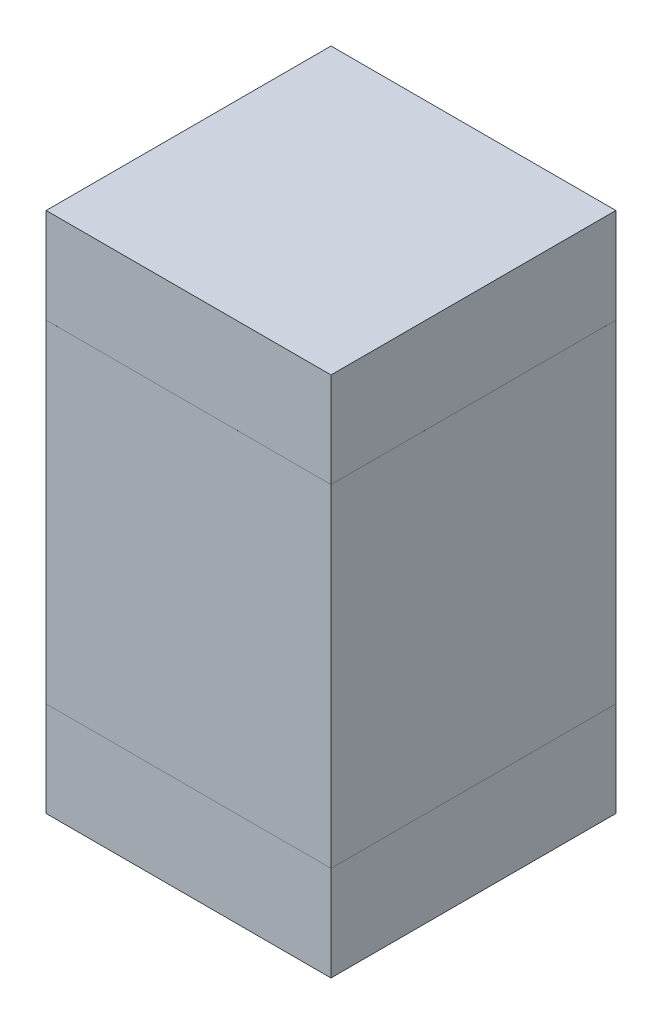
ISO-10303-21;
HEADER;
FILE_DESCRIPTION(('STEP AP214'),'2;1');
FILE_NAME('part.step','',(''),(''),'','','');
FILE_SCHEMA(('AUTOMOTIVE_DESIGN { 1 0 10303 214 1 1 1 1 }'));
ENDSEC;
DATA;
#1=APPLICATION_CONTEXT('core data for automotive mechanical design processes');
#2=APPLICATION_PROTOCOL_DEFINITION('international standard','automotive_design',2000,#1);
#3=PRODUCT_CONTEXT('',#1,'mechanical');
#4=PRODUCT('Part','Part','',(#3));
#5=PRODUCT_RELATED_PRODUCT_CATEGORY('part','',(#4));
#6=PRODUCT_DEFINITION_FORMATION('','',#4);
#7=PRODUCT_DEFINITION_CONTEXT('part definition',#1,'design');
#8=PRODUCT_DEFINITION('design','',#6,#7);
#9=PRODUCT_DEFINITION_SHAPE('','',#8);
#10=(LENGTH_UNIT() NAMED_UNIT(*) SI_UNIT(.MILLI.,.METRE.));
#11=(NAMED_UNIT(*) PLANE_ANGLE_UNIT() SI_UNIT($,.RADIAN.));
#12=(NAMED_UNIT(*) SI_UNIT($,.STERADIAN.) SOLID_ANGLE_UNIT());
#13=UNCERTAINTY_MEASURE_WITH_UNIT(LENGTH_MEASURE(1.E-05),#10,'distance_accuracy_value','');
#14=(GEOMETRIC_REPRESENTATION_CONTEXT(3) GLOBAL_UNCERTAINTY_ASSIGNED_CONTEXT((#13)) GLOBAL_UNIT_ASSIGNED_CONTEXT((#10,
#11,#12)) REPRESENTATION_CONTEXT('',''));
#15=CARTESIAN_POINT('',(0.,0.,0.));
#16=DIRECTION('',(0.,0.,1.));
#17=DIRECTION('',(1.,0.,0.));
#18=AXIS2_PLACEMENT_3D('',#15,#16,#17);
#19=CARTESIAN_POINT('',(1.449994365938,1.924995622559,0.5999988));
#20=DIRECTION('',(0.,0.,-1.));
#21=DIRECTION('',(0.,-1.,0.));
#22=AXIS2_PLACEMENT_3D('',#19,#20,#21);
#23=PLANE('',#22);
#24=DIRECTION('',(-1.,0.,0.));
#25=VECTOR('',#24,1.);
#26=CARTESIAN_POINT('',(1.449994365938,1.924995622559,0.5999988));
#27=LINE('',#26,#25);
#28=CARTESIAN_POINT('',(1.449994365938,1.924995622559,0.5999988));
#29=VERTEX_POINT('',#28);
#30=CARTESIAN_POINT('',(0.849995565938,1.924995622559,0.5999988));
#31=VERTEX_POINT('',#30);
#32=EDGE_CURVE('P0_E79',#29,#31,#27,.T.);
#33=ORIENTED_EDGE('',*,*,#32,.T.);
#34=DIRECTION('',(0.,-1.,0.));
#35=VECTOR('',#34,1.);
#36=CARTESIAN_POINT('',(0.849995565938,1.924995622559,0.5999988));
#37=LINE('',#36,#35);
#38=CARTESIAN_POINT('',(0.849995565938,1.224994482559,0.5999988));
#39=VERTEX_POINT('',#38);
#40=EDGE_CURVE('P0_E101',#31,#39,#37,.T.);
#41=ORIENTED_EDGE('',*,*,#40,.T.);
#42=DIRECTION('',(1.,0.,0.));
#43=VECTOR('',#42,1.);
#44=CARTESIAN_POINT('',(0.849995565938,1.224994482559,0.5999988));
#45=LINE('',#44,#43);
#46=CARTESIAN_POINT('',(1.449994365938,1.224994482559,0.5999988));
#47=VERTEX_POINT('',#46);
#48=EDGE_CURVE('P0_E72',#39,#47,#45,.T.);
#49=ORIENTED_EDGE('',*,*,#48,.T.);
#50=DIRECTION('',(0.,1.,0.));
#51=VECTOR('',#50,1.);
#52=CARTESIAN_POINT('',(1.449994365938,1.224994482559,0.5999988));
#53=LINE('',#52,#51);
#54=EDGE_CURVE('P0_E11',#47,#29,#53,.T.);
#55=ORIENTED_EDGE('',*,*,#54,.T.);
#56=EDGE_LOOP('',(#33,#41,#49,#55));
#57=FACE_BOUND('',#56,.T.);
#58=ADVANCED_FACE('P0_F17',(#57),#23,.F.);
#59=CARTESIAN_POINT('',(1.449994365938,1.924995622559,0.));
#60=DIRECTION('',(0.,0.,-1.));
#61=DIRECTION('',(0.,-1.,0.));
#62=AXIS2_PLACEMENT_3D('',#59,#60,#61);
#63=PLANE('',#62);
#64=DIRECTION('',(0.,1.,0.));
#65=VECTOR('',#64,1.);
#66=CARTESIAN_POINT('',(1.449994365938,1.224994482559,0.));
#67=LINE('',#66,#65);
#68=CARTESIAN_POINT('',(1.449994365938,1.224994482559,0.));
#69=VERTEX_POINT('',#68);
#70=CARTESIAN_POINT('',(1.449994365938,1.924995622559,0.));
#71=VERTEX_POINT('',#70);
#72=EDGE_CURVE('P0_E20',#69,#71,#67,.T.);
#73=ORIENTED_EDGE('',*,*,#72,.F.);
#74=DIRECTION('',(1.,0.,0.));
#75=VECTOR('',#74,1.);
#76=CARTESIAN_POINT('',(0.849995565938,1.224994482559,0.));
#77=LINE('',#76,#75);
#78=CARTESIAN_POINT('',(0.849995565938,1.224994482559,0.));
#79=VERTEX_POINT('',#78);
#80=EDGE_CURVE('P0_E102',#79,#69,#77,.T.);
#81=ORIENTED_EDGE('',*,*,#80,.F.);
#82=DIRECTION('',(0.,-1.,0.));
#83=VECTOR('',#82,1.);
#84=CARTESIAN_POINT('',(0.849995565938,1.924995622559,0.));
#85=LINE('',#84,#83);
#86=CARTESIAN_POINT('',(0.849995565938,1.924995622559,0.));
#87=VERTEX_POINT('',#86);
#88=EDGE_CURVE('P0_E81',#87,#79,#85,.T.);
#89=ORIENTED_EDGE('',*,*,#88,.F.);
#90=DIRECTION('',(-1.,0.,0.));
#91=VECTOR('',#90,1.);
#92=CARTESIAN_POINT('',(1.449994365938,1.924995622559,0.));
#93=LINE('',#92,#91);
#94=EDGE_CURVE('P0_E77',#71,#87,#93,.T.);
#95=ORIENTED_EDGE('',*,*,#94,.F.);
#96=EDGE_LOOP('',(#73,#81,#89,#95));
#97=FACE_BOUND('',#96,.T.);
#98=ADVANCED_FACE('P0_F83',(#97),#63,.T.);
#99=CARTESIAN_POINT('',(1.449994365938,1.224994482559,0.));
#100=DIRECTION('',(-1.,0.,0.));
#101=DIRECTION('',(0.,0.,1.));
#102=AXIS2_PLACEMENT_3D('',#99,#100,#101);
#103=PLANE('',#102);
#104=ORIENTED_EDGE('',*,*,#72,.T.);
#105=DIRECTION('',(0.,0.,1.));
#106=VECTOR('',#105,1.);
#107=CARTESIAN_POINT('',(1.449994365938,1.924995622559,0.));
#108=LINE('',#107,#106);
#109=EDGE_CURVE('P0_E63',#71,#29,#108,.T.);
#110=ORIENTED_EDGE('',*,*,#109,.T.);
#111=ORIENTED_EDGE('',*,*,#54,.F.);
#112=DIRECTION('',(0.,0.,1.));
#113=VECTOR('',#112,1.);
#114=CARTESIAN_POINT('',(1.449994365938,1.224994482559,0.));
#115=LINE('',#114,#113);
#116=EDGE_CURVE('P0_E66',#69,#47,#115,.T.);
#117=ORIENTED_EDGE('',*,*,#116,.F.);
#118=EDGE_LOOP('',(#104,#110,#111,#117));
#119=FACE_BOUND('',#118,.T.);
#120=ADVANCED_FACE('P0_F62',(#119),#103,.F.);
#121=CARTESIAN_POINT('',(0.849995565938,1.224994482559,0.));
#122=DIRECTION('',(0.,1.,0.));
#123=DIRECTION('',(1.,0.,0.));
#124=AXIS2_PLACEMENT_3D('',#121,#122,#123);
#125=PLANE('',#124);
#126=ORIENTED_EDGE('',*,*,#80,.T.);
#127=ORIENTED_EDGE('',*,*,#116,.T.);
#128=ORIENTED_EDGE('',*,*,#48,.F.);
#129=DIRECTION('',(0.,0.,1.));
#130=VECTOR('',#129,1.);
#131=CARTESIAN_POINT('',(0.849995565938,1.224994482559,0.));
#132=LINE('',#131,#130);
#133=EDGE_CURVE('P0_E96',#79,#39,#132,.T.);
#134=ORIENTED_EDGE('',*,*,#133,.F.);
#135=EDGE_LOOP('',(#126,#127,#128,#134));
#136=FACE_BOUND('',#135,.T.);
#137=ADVANCED_FACE('P0_F114',(#136),#125,.F.);
#138=CARTESIAN_POINT('',(0.849995565938,1.924995622559,0.));
#139=DIRECTION('',(1.,0.,0.));
#140=DIRECTION('',(0.,1.,0.));
#141=AXIS2_PLACEMENT_3D('',#138,#139,#140);
#142=PLANE('',#141);
#143=ORIENTED_EDGE('',*,*,#88,.T.);
#144=ORIENTED_EDGE('',*,*,#133,.T.);
#145=ORIENTED_EDGE('',*,*,#40,.F.);
#146=DIRECTION('',(0.,0.,1.));
#147=VECTOR('',#146,1.);
#148=CARTESIAN_POINT('',(0.849995565938,1.924995622559,0.));
#149=LINE('',#148,#147);
#150=EDGE_CURVE('P0_E87',#87,#31,#149,.T.);
#151=ORIENTED_EDGE('',*,*,#150,.F.);
#152=EDGE_LOOP('',(#143,#144,#145,#151));
#153=FACE_BOUND('',#152,.T.);
#154=ADVANCED_FACE('P0_F172',(#153),#142,.F.);
#155=CARTESIAN_POINT('',(1.449994365938,1.924995622559,0.));
#156=DIRECTION('',(0.,-1.,0.));
#157=DIRECTION('',(0.,0.,-1.));
#158=AXIS2_PLACEMENT_3D('',#155,#156,#157);
#159=PLANE('',#158);
#160=ORIENTED_EDGE('',*,*,#94,.T.);
#161=ORIENTED_EDGE('',*,*,#150,.T.);
#162=ORIENTED_EDGE('',*,*,#32,.F.);
#163=ORIENTED_EDGE('',*,*,#109,.F.);
#164=EDGE_LOOP('',(#160,#161,#162,#163));
#165=FACE_BOUND('',#164,.T.);
#166=ADVANCED_FACE('P0_F75',(#165),#159,.F.);
#167=CLOSED_SHELL('',(#58,#98,#120,#137,#154,#166));
#168=MANIFOLD_SOLID_BREP('P0_B1',#167);
#169=CARTESIAN_POINT('',(1.449994365938,2.124998160195,0.5999988));
#170=DIRECTION('',(0.,0.,-1.));
#171=DIRECTION('',(0.,-1.,0.));
#172=AXIS2_PLACEMENT_3D('',#169,#170,#171);
#173=PLANE('',#172);
#174=DIRECTION('',(-1.,0.,0.));
#175=VECTOR('',#174,1.);
#176=CARTESIAN_POINT('',(1.449994365938,2.124998160195,0.5999988));
#177=LINE('',#176,#175);
#178=CARTESIAN_POINT('',(1.449994365938,2.124998160195,0.5999988));
#179=VERTEX_POINT('',#178);
#180=CARTESIAN_POINT('',(0.849995565938,2.124998160195,0.5999988));
#181=VERTEX_POINT('',#180);
#182=EDGE_CURVE('P1_E97',#179,#181,#177,.T.);
#183=ORIENTED_EDGE('',*,*,#182,.T.);
#184=DIRECTION('',(0.,-1.,0.));
#185=VECTOR('',#184,1.);
#186=CARTESIAN_POINT('',(0.849995565938,2.124998160195,0.5999988));
#187=LINE('',#186,#185);
#188=CARTESIAN_POINT('',(0.849995565938,1.924998560195,0.5999988));
#189=VERTEX_POINT('',#188);
#190=EDGE_CURVE('P1_E76',#181,#189,#187,.T.);
#191=ORIENTED_EDGE('',*,*,#190,.T.);
#192=DIRECTION('',(1.,0.,0.));
#193=VECTOR('',#192,1.);
#194=CARTESIAN_POINT('',(0.849995565938,1.924998560195,0.5999988));
#195=LINE('',#194,#193);
#196=CARTESIAN_POINT('',(1.449994365938,1.924998560195,0.5999988));
#197=VERTEX_POINT('',#196);
#198=EDGE_CURVE('P1_E81',#189,#197,#195,.T.);
#199=ORIENTED_EDGE('',*,*,#198,.T.);
#200=DIRECTION('',(0.,1.,0.));
#201=VECTOR('',#200,1.);
#202=CARTESIAN_POINT('',(1.449994365938,1.924998560195,0.5999988));
#203=LINE('',#202,#201);
#204=EDGE_CURVE('P1_E11',#197,#179,#203,.T.);
#205=ORIENTED_EDGE('',*,*,#204,.T.);
#206=EDGE_LOOP('',(#183,#191,#199,#205));
#207=FACE_BOUND('',#206,.T.);
#208=ADVANCED_FACE('P1_F17',(#207),#173,.F.);
#209=CARTESIAN_POINT('',(1.449994365938,2.124998160195,0.));
#210=DIRECTION('',(0.,0.,-1.));
#211=DIRECTION('',(0.,-1.,0.));
#212=AXIS2_PLACEMENT_3D('',#209,#210,#211);
#213=PLANE('',#212);
#214=DIRECTION('',(0.,1.,0.));
#215=VECTOR('',#214,1.);
#216=CARTESIAN_POINT('',(1.449994365938,1.924998560195,0.));
#217=LINE('',#216,#215);
#218=CARTESIAN_POINT('',(1.449994365938,1.924998560195,0.));
#219=VERTEX_POINT('',#218);
#220=CARTESIAN_POINT('',(1.449994365938,2.124998160195,0.));
#221=VERTEX_POINT('',#220);
#222=EDGE_CURVE('P1_E25',#219,#221,#217,.T.);
#223=ORIENTED_EDGE('',*,*,#222,.F.);
#224=DIRECTION('',(1.,0.,0.));
#225=VECTOR('',#224,1.);
#226=CARTESIAN_POINT('',(0.849995565938,1.924998560195,0.));
#227=LINE('',#226,#225);
#228=CARTESIAN_POINT('',(0.849995565938,1.924998560195,0.));
#229=VERTEX_POINT('',#228);
#230=EDGE_CURVE('P1_E66',#229,#219,#227,.T.);
#231=ORIENTED_EDGE('',*,*,#230,.F.);
#232=DIRECTION('',(0.,-1.,0.));
#233=VECTOR('',#232,1.);
#234=CARTESIAN_POINT('',(0.849995565938,2.124998160195,0.));
#235=LINE('',#234,#233);
#236=CARTESIAN_POINT('',(0.849995565938,2.124998160195,0.));
#237=VERTEX_POINT('',#236);
#238=EDGE_CURVE('P1_E70',#237,#229,#235,.T.);
#239=ORIENTED_EDGE('',*,*,#238,.F.);
#240=DIRECTION('',(-1.,0.,0.));
#241=VECTOR('',#240,1.);
#242=CARTESIAN_POINT('',(1.449994365938,2.124998160195,0.));
#243=LINE('',#242,#241);
#244=EDGE_CURVE('P1_E114',#221,#237,#243,.T.);
#245=ORIENTED_EDGE('',*,*,#244,.F.);
#246=EDGE_LOOP('',(#223,#231,#239,#245));
#247=FACE_BOUND('',#246,.T.);
#248=ADVANCED_FACE('P1_F68',(#247),#213,.T.);
#249=CARTESIAN_POINT('',(1.449994365938,1.924998560195,0.));
#250=DIRECTION('',(-1.,0.,0.));
#251=DIRECTION('',(0.,0.,1.));
#252=AXIS2_PLACEMENT_3D('',#249,#250,#251);
#253=PLANE('',#252);
#254=ORIENTED_EDGE('',*,*,#222,.T.);
#255=DIRECTION('',(0.,0.,1.));
#256=VECTOR('',#255,1.);
#257=CARTESIAN_POINT('',(1.449994365938,2.124998160195,0.));
#258=LINE('',#257,#256);
#259=EDGE_CURVE('P1_E91',#221,#179,#258,.T.);
#260=ORIENTED_EDGE('',*,*,#259,.T.);
#261=ORIENTED_EDGE('',*,*,#204,.F.);
#262=DIRECTION('',(0.,0.,1.));
#263=VECTOR('',#262,1.);
#264=CARTESIAN_POINT('',(1.449994365938,1.924998560195,0.));
#265=LINE('',#264,#263);
#266=EDGE_CURVE('P1_E75',#219,#197,#265,.T.);
#267=ORIENTED_EDGE('',*,*,#266,.F.);
#268=EDGE_LOOP('',(#254,#260,#261,#267));
#269=FACE_BOUND('',#268,.T.);
#270=ADVANCED_FACE('P1_F110',(#269),#253,.F.);
#271=CARTESIAN_POINT('',(0.849995565938,1.924998560195,0.));
#272=DIRECTION('',(0.,1.,0.));
#273=DIRECTION('',(1.,0.,0.));
#274=AXIS2_PLACEMENT_3D('',#271,#272,#273);
#275=PLANE('',#274);
#276=ORIENTED_EDGE('',*,*,#230,.T.);
#277=ORIENTED_EDGE('',*,*,#266,.T.);
#278=ORIENTED_EDGE('',*,*,#198,.F.);
#279=DIRECTION('',(0.,0.,1.));
#280=VECTOR('',#279,1.);
#281=CARTESIAN_POINT('',(0.849995565938,1.924998560195,0.));
#282=LINE('',#281,#280);
#283=EDGE_CURVE('P1_E79',#229,#189,#282,.T.);
#284=ORIENTED_EDGE('',*,*,#283,.F.);
#285=EDGE_LOOP('',(#276,#277,#278,#284));
#286=FACE_BOUND('',#285,.T.);
#287=ADVANCED_FACE('P1_F80',(#286),#275,.F.);
#288=CARTESIAN_POINT('',(0.849995565938,2.124998160195,0.));
#289=DIRECTION('',(1.,0.,0.));
#290=DIRECTION('',(0.,1.,0.));
#291=AXIS2_PLACEMENT_3D('',#288,#289,#290);
#292=PLANE('',#291);
#293=ORIENTED_EDGE('',*,*,#238,.T.);
#294=ORIENTED_EDGE('',*,*,#283,.T.);
#295=ORIENTED_EDGE('',*,*,#190,.F.);
#296=DIRECTION('',(0.,0.,1.));
#297=VECTOR('',#296,1.);
#298=CARTESIAN_POINT('',(0.849995565938,2.124998160195,0.));
#299=LINE('',#298,#297);
#300=EDGE_CURVE('P1_E88',#237,#181,#299,.T.);
#301=ORIENTED_EDGE('',*,*,#300,.F.);
#302=EDGE_LOOP('',(#293,#294,#295,#301));
#303=FACE_BOUND('',#302,.T.);
#304=ADVANCED_FACE('P1_F86',(#303),#292,.F.);
#305=CARTESIAN_POINT('',(1.449994365938,2.124998160195,0.));
#306=DIRECTION('',(0.,-1.,0.));
#307=DIRECTION('',(0.,0.,-1.));
#308=AXIS2_PLACEMENT_3D('',#305,#306,#307);
#309=PLANE('',#308);
#310=ORIENTED_EDGE('',*,*,#244,.T.);
#311=ORIENTED_EDGE('',*,*,#300,.T.);
#312=ORIENTED_EDGE('',*,*,#182,.F.);
#313=ORIENTED_EDGE('',*,*,#259,.F.);
#314=EDGE_LOOP('',(#310,#311,#312,#313));
#315=FACE_BOUND('',#314,.T.);
#316=ADVANCED_FACE('P1_F113',(#315),#309,.F.);
#317=CLOSED_SHELL('',(#208,#248,#270,#287,#304,#316));
#318=MANIFOLD_SOLID_BREP('P1_B1',#317);
#319=CARTESIAN_POINT('',(1.449994365938,1.224996634316,0.5999988));
#320=DIRECTION('',(0.,0.,-1.));
#321=DIRECTION('',(0.,-1.,0.));
#322=AXIS2_PLACEMENT_3D('',#319,#320,#321);
#323=PLANE('',#322);
#324=DIRECTION('',(-1.,0.,0.));
#325=VECTOR('',#324,1.);
#326=CARTESIAN_POINT('',(1.449994365938,1.224996634316,0.5999988));
#327=LINE('',#326,#325);
#328=CARTESIAN_POINT('',(1.449994365938,1.224996634316,0.5999988));
#329=VERTEX_POINT('',#328);
#330=CARTESIAN_POINT('',(0.849995565938,1.224996634316,0.5999988));
#331=VERTEX_POINT('',#330);
#332=EDGE_CURVE('P2_E82',#329,#331,#327,.T.);
#333=ORIENTED_EDGE('',*,*,#332,.T.);
#334=DIRECTION('',(0.,-1.,0.));
#335=VECTOR('',#334,1.);
#336=CARTESIAN_POINT('',(0.849995565938,1.224996634316,0.5999988));
#337=LINE('',#336,#335);
#338=CARTESIAN_POINT('',(0.849995565938,1.024997034316,0.5999988));
#339=VERTEX_POINT('',#338);
#340=EDGE_CURVE('P2_E100',#331,#339,#337,.T.);
#341=ORIENTED_EDGE('',*,*,#340,.T.);
#342=DIRECTION('',(1.,0.,0.));
#343=VECTOR('',#342,1.);
#344=CARTESIAN_POINT('',(0.849995565938,1.024997034316,0.5999988));
#345=LINE('',#344,#343);
#346=CARTESIAN_POINT('',(1.449994365938,1.024997034316,0.5999988));
#347=VERTEX_POINT('',#346);
#348=EDGE_CURVE('P2_E75',#339,#347,#345,.T.);
#349=ORIENTED_EDGE('',*,*,#348,.T.);
#350=DIRECTION('',(0.,1.,0.));
#351=VECTOR('',#350,1.);
#352=CARTESIAN_POINT('',(1.449994365938,1.024997034316,0.5999988));
#353=LINE('',#352,#351);
#354=EDGE_CURVE('P2_E11',#347,#329,#353,.T.);
#355=ORIENTED_EDGE('',*,*,#354,.T.);
#356=EDGE_LOOP('',(#333,#341,#349,#355));
#357=FACE_BOUND('',#356,.T.);
#358=ADVANCED_FACE('P2_F17',(#357),#323,.F.);
#359=CARTESIAN_POINT('',(1.449994365938,1.224996634316,0.));
#360=DIRECTION('',(0.,0.,-1.));
#361=DIRECTION('',(0.,-1.,0.));
#362=AXIS2_PLACEMENT_3D('',#359,#360,#361);
#363=PLANE('',#362);
#364=DIRECTION('',(0.,1.,0.));
#365=VECTOR('',#364,1.);
#366=CARTESIAN_POINT('',(1.449994365938,1.024997034316,0.));
#367=LINE('',#366,#365);
#368=CARTESIAN_POINT('',(1.449994365938,1.024997034316,0.));
#369=VERTEX_POINT('',#368);
#370=CARTESIAN_POINT('',(1.449994365938,1.224996634316,0.));
#371=VERTEX_POINT('',#370);
#372=EDGE_CURVE('P2_E20',#369,#371,#367,.T.);
#373=ORIENTED_EDGE('',*,*,#372,.F.);
#374=DIRECTION('',(1.,0.,0.));
#375=VECTOR('',#374,1.);
#376=CARTESIAN_POINT('',(0.849995565938,1.024997034316,0.));
#377=LINE('',#376,#375);
#378=CARTESIAN_POINT('',(0.849995565938,1.024997034316,0.));
#379=VERTEX_POINT('',#378);
#380=EDGE_CURVE('P2_E98',#379,#369,#377,.T.);
#381=ORIENTED_EDGE('',*,*,#380,.F.);
#382=DIRECTION('',(0.,-1.,0.));
#383=VECTOR('',#382,1.);
#384=CARTESIAN_POINT('',(0.849995565938,1.224996634316,0.));
#385=LINE('',#384,#383);
#386=CARTESIAN_POINT('',(0.849995565938,1.224996634316,0.));
#387=VERTEX_POINT('',#386);
#388=EDGE_CURVE('P2_E84',#387,#379,#385,.T.);
#389=ORIENTED_EDGE('',*,*,#388,.F.);
#390=DIRECTION('',(-1.,0.,0.));
#391=VECTOR('',#390,1.);
#392=CARTESIAN_POINT('',(1.449994365938,1.224996634316,0.));
#393=LINE('',#392,#391);
#394=EDGE_CURVE('P2_E80',#371,#387,#393,.T.);
#395=ORIENTED_EDGE('',*,*,#394,.F.);
#396=EDGE_LOOP('',(#373,#381,#389,#395));
#397=FACE_BOUND('',#396,.T.);
#398=ADVANCED_FACE('P2_F86',(#397),#363,.T.);
#399=CARTESIAN_POINT('',(1.449994365938,1.024997034316,0.));
#400=DIRECTION('',(-1.,0.,0.));
#401=DIRECTION('',(0.,0.,1.));
#402=AXIS2_PLACEMENT_3D('',#399,#400,#401);
#403=PLANE('',#402);
#404=ORIENTED_EDGE('',*,*,#372,.T.);
#405=DIRECTION('',(0.,0.,1.));
#406=VECTOR('',#405,1.);
#407=CARTESIAN_POINT('',(1.449994365938,1.224996634316,0.));
#408=LINE('',#407,#406);
#409=EDGE_CURVE('P2_E69',#371,#329,#408,.T.);
#410=ORIENTED_EDGE('',*,*,#409,.T.);
#411=ORIENTED_EDGE('',*,*,#354,.F.);
#412=DIRECTION('',(0.,0.,1.));
#413=VECTOR('',#412,1.);
#414=CARTESIAN_POINT('',(1.449994365938,1.024997034316,0.));
#415=LINE('',#414,#413);
#416=EDGE_CURVE('P2_E72',#369,#347,#415,.T.);
#417=ORIENTED_EDGE('',*,*,#416,.F.);
#418=EDGE_LOOP('',(#404,#410,#411,#417));
#419=FACE_BOUND('',#418,.T.);
#420=ADVANCED_FACE('P2_F68',(#419),#403,.F.);
#421=CARTESIAN_POINT('',(0.849995565938,1.024997034316,0.));
#422=DIRECTION('',(0.,1.,0.));
#423=DIRECTION('',(1.,0.,0.));
#424=AXIS2_PLACEMENT_3D('',#421,#422,#423);
#425=PLANE('',#424);
#426=ORIENTED_EDGE('',*,*,#380,.T.);
#427=ORIENTED_EDGE('',*,*,#416,.T.);
#428=ORIENTED_EDGE('',*,*,#348,.F.);
#429=DIRECTION('',(0.,0.,1.));
#430=VECTOR('',#429,1.);
#431=CARTESIAN_POINT('',(0.849995565938,1.024997034316,0.));
#432=LINE('',#431,#430);
#433=EDGE_CURVE('P2_E106',#379,#339,#432,.T.);
#434=ORIENTED_EDGE('',*,*,#433,.F.);
#435=EDGE_LOOP('',(#426,#427,#428,#434));
#436=FACE_BOUND('',#435,.T.);
#437=ADVANCED_FACE('P2_F115',(#436),#425,.F.);
#438=CARTESIAN_POINT('',(0.849995565938,1.224996634316,0.));
#439=DIRECTION('',(1.,0.,0.));
#440=DIRECTION('',(0.,1.,0.));
#441=AXIS2_PLACEMENT_3D('',#438,#439,#440);
#442=PLANE('',#441);
#443=ORIENTED_EDGE('',*,*,#388,.T.);
#444=ORIENTED_EDGE('',*,*,#433,.T.);
#445=ORIENTED_EDGE('',*,*,#340,.F.);
#446=DIRECTION('',(0.,0.,1.));
#447=VECTOR('',#446,1.);
#448=CARTESIAN_POINT('',(0.849995565938,1.224996634316,0.));
#449=LINE('',#448,#447);
#450=EDGE_CURVE('P2_E90',#387,#331,#449,.T.);
#451=ORIENTED_EDGE('',*,*,#450,.F.);
#452=EDGE_LOOP('',(#443,#444,#445,#451));
#453=FACE_BOUND('',#452,.T.);
#454=ADVANCED_FACE('P2_F118',(#453),#442,.F.);
#455=CARTESIAN_POINT('',(1.449994365938,1.224996634316,0.));
#456=DIRECTION('',(0.,-1.,0.));
#457=DIRECTION('',(0.,0.,-1.));
#458=AXIS2_PLACEMENT_3D('',#455,#456,#457);
#459=PLANE('',#458);
#460=ORIENTED_EDGE('',*,*,#394,.T.);
#461=ORIENTED_EDGE('',*,*,#450,.T.);
#462=ORIENTED_EDGE('',*,*,#332,.F.);
#463=ORIENTED_EDGE('',*,*,#409,.F.);
#464=EDGE_LOOP('',(#460,#461,#462,#463));
#465=FACE_BOUND('',#464,.T.);
#466=ADVANCED_FACE('P2_F78',(#465),#459,.F.);
#467=CLOSED_SHELL('',(#358,#398,#420,#437,#454,#466));
#468=MANIFOLD_SOLID_BREP('P2_B1',#467);
#469=ADVANCED_BREP_SHAPE_REPRESENTATION('',(#18,#168,#318,#468),#14);
#470=SHAPE_DEFINITION_REPRESENTATION(#9,#469);
ENDSEC;
END-ISO-10303-21;
